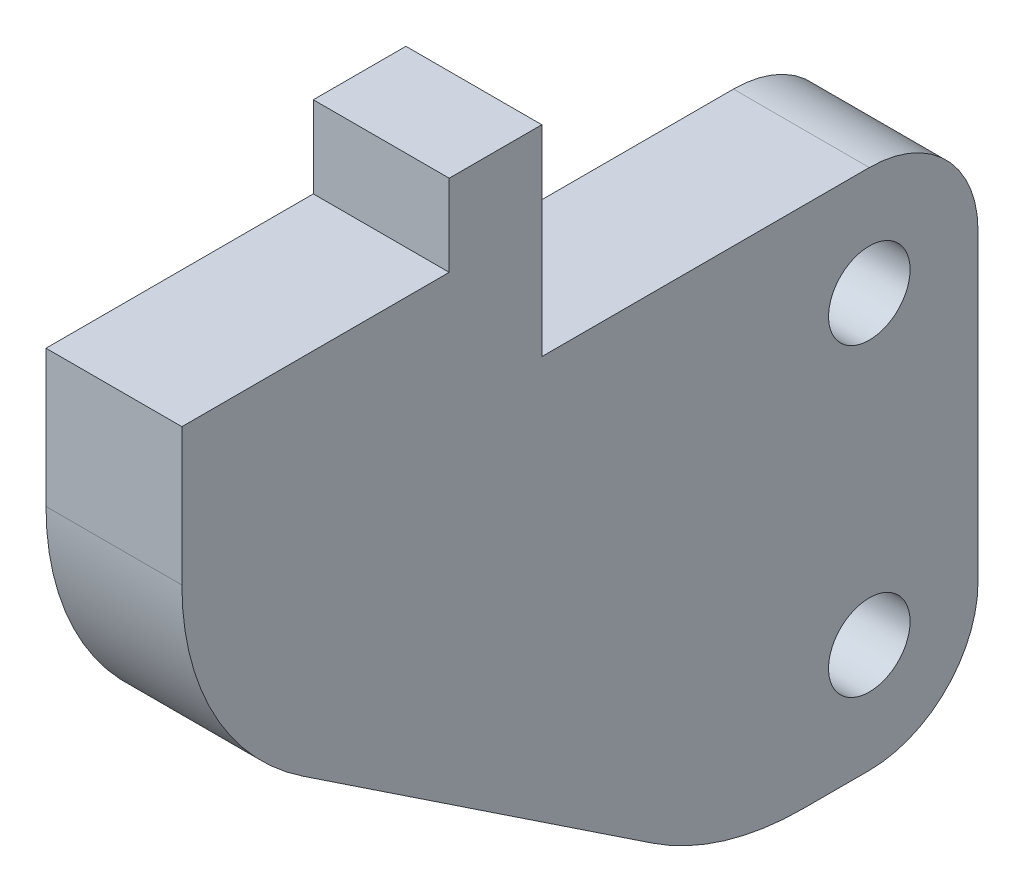
ISO-10303-21;
HEADER;
FILE_DESCRIPTION(('STEP AP214'),'2;1');
FILE_NAME('part.step','',(''),(''),'','','');
FILE_SCHEMA(('AUTOMOTIVE_DESIGN { 1 0 10303 214 1 1 1 1 }'));
ENDSEC;
DATA;
#1=APPLICATION_CONTEXT('core data for automotive mechanical design processes');
#2=APPLICATION_PROTOCOL_DEFINITION('international standard','automotive_design',2000,#1);
#3=PRODUCT_CONTEXT('',#1,'mechanical');
#4=PRODUCT('Part','Part','',(#3));
#5=PRODUCT_RELATED_PRODUCT_CATEGORY('part','',(#4));
#6=PRODUCT_DEFINITION_FORMATION('','',#4);
#7=PRODUCT_DEFINITION_CONTEXT('part definition',#1,'design');
#8=PRODUCT_DEFINITION('design','',#6,#7);
#9=PRODUCT_DEFINITION_SHAPE('','',#8);
#10=(LENGTH_UNIT() NAMED_UNIT(*) SI_UNIT(.MILLI.,.METRE.));
#11=(NAMED_UNIT(*) PLANE_ANGLE_UNIT() SI_UNIT($,.RADIAN.));
#12=(NAMED_UNIT(*) SI_UNIT($,.STERADIAN.) SOLID_ANGLE_UNIT());
#13=UNCERTAINTY_MEASURE_WITH_UNIT(LENGTH_MEASURE(1.E-05),#10,'distance_accuracy_value','');
#14=(GEOMETRIC_REPRESENTATION_CONTEXT(3) GLOBAL_UNCERTAINTY_ASSIGNED_CONTEXT((#13)) GLOBAL_UNIT_ASSIGNED_CONTEXT((#10,
#11,#12)) REPRESENTATION_CONTEXT('',''));
#15=CARTESIAN_POINT('',(0.,0.,0.));
#16=DIRECTION('',(0.,0.,1.));
#17=DIRECTION('',(1.,0.,0.));
#18=AXIS2_PLACEMENT_3D('',#15,#16,#17);
#19=CARTESIAN_POINT('',(5.,73.9444814686594,-76.8456806276459));
#20=DIRECTION('',(-1.,0.,0.));
#21=DIRECTION('',(0.,0.,1.));
#22=AXIS2_PLACEMENT_3D('',#19,#20,#21);
#23=CYLINDRICAL_SURFACE('',#22,4.00000000000001);
#24=CARTESIAN_POINT('',(0.,73.9444814686594,-76.8456806276459));
#25=DIRECTION('',(1.,0.,0.));
#26=DIRECTION('',(0.,0.,-1.));
#27=AXIS2_PLACEMENT_3D('',#24,#25,#26);
#28=CIRCLE('',#27,4.00000000000001);
#29=CARTESIAN_POINT('',(0.,69.9444814686594,-76.8456806276459));
#30=VERTEX_POINT('',#29);
#31=CARTESIAN_POINT('',(0.,73.9444814686594,-80.8456806276459));
#32=VERTEX_POINT('',#31);
#33=EDGE_CURVE('E180',#30,#32,#28,.T.);
#34=ORIENTED_EDGE('',*,*,#33,.T.);
#35=DIRECTION('',(-1.,0.,0.));
#36=VECTOR('',#35,1.);
#37=CARTESIAN_POINT('',(5.,73.9444814686594,-80.8456806276459));
#38=LINE('',#37,#36);
#39=CARTESIAN_POINT('',(5.,73.9444814686594,-80.8456806276459));
#40=VERTEX_POINT('',#39);
#41=EDGE_CURVE('E11',#40,#32,#38,.T.);
#42=ORIENTED_EDGE('',*,*,#41,.F.);
#43=CARTESIAN_POINT('',(5.,73.9444814686594,-76.8456806276459));
#44=DIRECTION('',(1.,0.,0.));
#45=DIRECTION('',(0.,0.,-1.));
#46=AXIS2_PLACEMENT_3D('',#43,#44,#45);
#47=CIRCLE('',#46,4.00000000000001);
#48=CARTESIAN_POINT('',(5.,69.9444814686594,-76.8456806276459));
#49=VERTEX_POINT('',#48);
#50=EDGE_CURVE('E111',#49,#40,#47,.T.);
#51=ORIENTED_EDGE('',*,*,#50,.F.);
#52=DIRECTION('',(-1.,0.,0.));
#53=VECTOR('',#52,1.);
#54=CARTESIAN_POINT('',(5.,69.9444814686594,-76.8456806276459));
#55=LINE('',#54,#53);
#56=EDGE_CURVE('E59',#49,#30,#55,.T.);
#57=ORIENTED_EDGE('',*,*,#56,.T.);
#58=EDGE_LOOP('',(#34,#42,#51,#57));
#59=FACE_BOUND('',#58,.T.);
#60=ADVANCED_FACE('F41',(#59),#23,.T.);
#61=CARTESIAN_POINT('',(5.,0.,-80.8456806276459));
#62=DIRECTION('',(0.,0.,-1.));
#63=DIRECTION('',(-1.,0.,0.));
#64=AXIS2_PLACEMENT_3D('',#61,#62,#63);
#65=PLANE('',#64);
#66=DIRECTION('',(0.,-1.,0.));
#67=VECTOR('',#66,1.);
#68=CARTESIAN_POINT('',(0.,0.,-80.8456806276459));
#69=LINE('',#68,#67);
#70=CARTESIAN_POINT('',(0.,85.1580090825985,-80.8456806276459));
#71=VERTEX_POINT('',#70);
#72=EDGE_CURVE('E183',#71,#32,#69,.T.);
#73=ORIENTED_EDGE('',*,*,#72,.F.);
#74=DIRECTION('',(-1.,0.,0.));
#75=VECTOR('',#74,1.);
#76=CARTESIAN_POINT('',(5.,85.1580090825985,-80.8456806276459));
#77=LINE('',#76,#75);
#78=CARTESIAN_POINT('',(5.,85.1580090825985,-80.8456806276459));
#79=VERTEX_POINT('',#78);
#80=EDGE_CURVE('E51',#79,#71,#77,.T.);
#81=ORIENTED_EDGE('',*,*,#80,.F.);
#82=DIRECTION('',(0.,-1.,0.));
#83=VECTOR('',#82,1.);
#84=CARTESIAN_POINT('',(5.,0.,-80.8456806276459));
#85=LINE('',#84,#83);
#86=EDGE_CURVE('E275',#79,#40,#85,.T.);
#87=ORIENTED_EDGE('',*,*,#86,.T.);
#88=ORIENTED_EDGE('',*,*,#41,.T.);
#89=EDGE_LOOP('',(#73,#81,#87,#88));
#90=FACE_BOUND('',#89,.T.);
#91=ADVANCED_FACE('F274',(#90),#65,.T.);
#92=CARTESIAN_POINT('',(5.,85.1580090825985,-76.8456806276459));
#93=DIRECTION('',(-1.,0.,0.));
#94=DIRECTION('',(0.,0.,1.));
#95=AXIS2_PLACEMENT_3D('',#92,#93,#94);
#96=CYLINDRICAL_SURFACE('',#95,4.00000000000001);
#97=CARTESIAN_POINT('',(0.,85.1580090825985,-76.8456806276459));
#98=DIRECTION('',(1.,0.,0.));
#99=DIRECTION('',(0.,0.,-1.));
#100=AXIS2_PLACEMENT_3D('',#97,#98,#99);
#101=CIRCLE('',#100,4.00000000000001);
#102=CARTESIAN_POINT('',(0.,89.1580090825985,-76.8456806276459));
#103=VERTEX_POINT('',#102);
#104=EDGE_CURVE('E187',#71,#103,#101,.T.);
#105=ORIENTED_EDGE('',*,*,#104,.T.);
#106=DIRECTION('',(-1.,0.,0.));
#107=VECTOR('',#106,1.);
#108=CARTESIAN_POINT('',(5.,89.1580090825985,-76.8456806276459));
#109=LINE('',#108,#107);
#110=CARTESIAN_POINT('',(5.,89.1580090825985,-76.8456806276459));
#111=VERTEX_POINT('',#110);
#112=EDGE_CURVE('E256',#111,#103,#109,.T.);
#113=ORIENTED_EDGE('',*,*,#112,.F.);
#114=CARTESIAN_POINT('',(5.,85.1580090825985,-76.8456806276459));
#115=DIRECTION('',(1.,0.,0.));
#116=DIRECTION('',(0.,0.,-1.));
#117=AXIS2_PLACEMENT_3D('',#114,#115,#116);
#118=CIRCLE('',#117,4.00000000000001);
#119=EDGE_CURVE('E265',#79,#111,#118,.T.);
#120=ORIENTED_EDGE('',*,*,#119,.F.);
#121=ORIENTED_EDGE('',*,*,#80,.T.);
#122=EDGE_LOOP('',(#105,#113,#120,#121));
#123=FACE_BOUND('',#122,.T.);
#124=ADVANCED_FACE('F263',(#123),#96,.T.);
#125=CARTESIAN_POINT('',(5.,89.1580090825985,0.));
#126=DIRECTION('',(0.,-1.,0.));
#127=DIRECTION('',(0.,0.,-1.));
#128=AXIS2_PLACEMENT_3D('',#125,#126,#127);
#129=PLANE('',#128);
#130=DIRECTION('',(0.,0.,1.));
#131=VECTOR('',#130,1.);
#132=CARTESIAN_POINT('',(0.,89.1580090825985,0.));
#133=LINE('',#132,#131);
#134=CARTESIAN_POINT('',(0.,89.1580090825985,-64.7949383441951));
#135=VERTEX_POINT('',#134);
#136=EDGE_CURVE('E190',#103,#135,#133,.T.);
#137=ORIENTED_EDGE('',*,*,#136,.T.);
#138=DIRECTION('',(-1.,0.,0.));
#139=VECTOR('',#138,1.);
#140=CARTESIAN_POINT('',(5.,89.1580090825985,-64.7949383441951));
#141=LINE('',#140,#139);
#142=CARTESIAN_POINT('',(5.,89.1580090825985,-64.7949383441951));
#143=VERTEX_POINT('',#142);
#144=EDGE_CURVE('E252',#143,#135,#141,.T.);
#145=ORIENTED_EDGE('',*,*,#144,.F.);
#146=DIRECTION('',(0.,0.,1.));
#147=VECTOR('',#146,1.);
#148=CARTESIAN_POINT('',(5.,89.1580090825985,0.));
#149=LINE('',#148,#147);
#150=EDGE_CURVE('E397',#111,#143,#149,.T.);
#151=ORIENTED_EDGE('',*,*,#150,.F.);
#152=ORIENTED_EDGE('',*,*,#112,.T.);
#153=EDGE_LOOP('',(#137,#145,#151,#152));
#154=FACE_BOUND('',#153,.T.);
#155=ADVANCED_FACE('F295',(#154),#129,.F.);
#156=CARTESIAN_POINT('',(5.,0.,-64.7949383441951));
#157=DIRECTION('',(0.,0.,1.));
#158=DIRECTION('',(1.,0.,0.));
#159=AXIS2_PLACEMENT_3D('',#156,#157,#158);
#160=PLANE('',#159);
#161=DIRECTION('',(0.,1.,0.));
#162=VECTOR('',#161,1.);
#163=CARTESIAN_POINT('',(0.,0.,-64.7949383441951));
#164=LINE('',#163,#162);
#165=CARTESIAN_POINT('',(0.,96.5477397147833,-64.7949383441951));
#166=VERTEX_POINT('',#165);
#167=EDGE_CURVE('E193',#135,#166,#164,.T.);
#168=ORIENTED_EDGE('',*,*,#167,.T.);
#169=DIRECTION('',(-1.,0.,0.));
#170=VECTOR('',#169,1.);
#171=CARTESIAN_POINT('',(5.,96.5477397147833,-64.7949383441951));
#172=LINE('',#171,#170);
#173=CARTESIAN_POINT('',(5.,96.5477397147833,-64.7949383441951));
#174=VERTEX_POINT('',#173);
#175=EDGE_CURVE('E248',#174,#166,#172,.T.);
#176=ORIENTED_EDGE('',*,*,#175,.F.);
#177=DIRECTION('',(0.,1.,0.));
#178=VECTOR('',#177,1.);
#179=CARTESIAN_POINT('',(5.,0.,-64.7949383441951));
#180=LINE('',#179,#178);
#181=EDGE_CURVE('E400',#143,#174,#180,.T.);
#182=ORIENTED_EDGE('',*,*,#181,.F.);
#183=ORIENTED_EDGE('',*,*,#144,.T.);
#184=EDGE_LOOP('',(#168,#176,#182,#183));
#185=FACE_BOUND('',#184,.T.);
#186=ADVANCED_FACE('F298',(#185),#160,.F.);
#187=CARTESIAN_POINT('',(5.,96.5477397147833,0.));
#188=DIRECTION('',(0.,-1.,0.));
#189=DIRECTION('',(0.,0.,-1.));
#190=AXIS2_PLACEMENT_3D('',#187,#188,#189);
#191=PLANE('',#190);
#192=DIRECTION('',(0.,0.,1.));
#193=VECTOR('',#192,1.);
#194=CARTESIAN_POINT('',(0.,96.5477397147833,0.));
#195=LINE('',#194,#193);
#196=CARTESIAN_POINT('',(0.,96.5477397147833,-61.3869910945006));
#197=VERTEX_POINT('',#196);
#198=EDGE_CURVE('E196',#166,#197,#195,.T.);
#199=ORIENTED_EDGE('',*,*,#198,.T.);
#200=DIRECTION('',(-1.,0.,0.));
#201=VECTOR('',#200,1.);
#202=CARTESIAN_POINT('',(5.,96.5477397147833,-61.3869910945006));
#203=LINE('',#202,#201);
#204=CARTESIAN_POINT('',(5.,96.5477397147833,-61.3869910945006));
#205=VERTEX_POINT('',#204);
#206=EDGE_CURVE('E244',#205,#197,#203,.T.);
#207=ORIENTED_EDGE('',*,*,#206,.F.);
#208=DIRECTION('',(0.,0.,1.));
#209=VECTOR('',#208,1.);
#210=CARTESIAN_POINT('',(5.,96.5477397147833,0.));
#211=LINE('',#210,#209);
#212=EDGE_CURVE('E403',#174,#205,#211,.T.);
#213=ORIENTED_EDGE('',*,*,#212,.F.);
#214=ORIENTED_EDGE('',*,*,#175,.T.);
#215=EDGE_LOOP('',(#199,#207,#213,#214));
#216=FACE_BOUND('',#215,.T.);
#217=ADVANCED_FACE('F302',(#216),#191,.F.);
#218=CARTESIAN_POINT('',(5.,0.,-61.3869910945006));
#219=DIRECTION('',(0.,0.,-1.));
#220=DIRECTION('',(-1.,0.,0.));
#221=AXIS2_PLACEMENT_3D('',#218,#219,#220);
#222=PLANE('',#221);
#223=DIRECTION('',(0.,-1.,0.));
#224=VECTOR('',#223,1.);
#225=CARTESIAN_POINT('',(0.,0.,-61.3869910945006));
#226=LINE('',#225,#224);
#227=CARTESIAN_POINT('',(0.,93.5477397147833,-61.3869910945006));
#228=VERTEX_POINT('',#227);
#229=EDGE_CURVE('E199',#197,#228,#226,.T.);
#230=ORIENTED_EDGE('',*,*,#229,.T.);
#231=DIRECTION('',(-1.,0.,0.));
#232=VECTOR('',#231,1.);
#233=CARTESIAN_POINT('',(5.,93.5477397147833,-61.3869910945006));
#234=LINE('',#233,#232);
#235=CARTESIAN_POINT('',(5.,93.5477397147833,-61.3869910945006));
#236=VERTEX_POINT('',#235);
#237=EDGE_CURVE('E240',#236,#228,#234,.T.);
#238=ORIENTED_EDGE('',*,*,#237,.F.);
#239=DIRECTION('',(0.,-1.,0.));
#240=VECTOR('',#239,1.);
#241=CARTESIAN_POINT('',(5.,0.,-61.3869910945006));
#242=LINE('',#241,#240);
#243=EDGE_CURVE('E406',#205,#236,#242,.T.);
#244=ORIENTED_EDGE('',*,*,#243,.F.);
#245=ORIENTED_EDGE('',*,*,#206,.T.);
#246=EDGE_LOOP('',(#230,#238,#244,#245));
#247=FACE_BOUND('',#246,.T.);
#248=ADVANCED_FACE('F306',(#247),#222,.F.);
#249=CARTESIAN_POINT('',(5.,93.5477397147833,0.));
#250=DIRECTION('',(0.,-1.,0.));
#251=DIRECTION('',(0.,0.,-1.));
#252=AXIS2_PLACEMENT_3D('',#249,#250,#251);
#253=PLANE('',#252);
#254=DIRECTION('',(0.,0.,1.));
#255=VECTOR('',#254,1.);
#256=CARTESIAN_POINT('',(0.,93.5477397147833,0.));
#257=LINE('',#256,#255);
#258=CARTESIAN_POINT('',(0.,93.5477397147833,-51.5504160783371));
#259=VERTEX_POINT('',#258);
#260=EDGE_CURVE('E202',#228,#259,#257,.T.);
#261=ORIENTED_EDGE('',*,*,#260,.T.);
#262=DIRECTION('',(-1.,0.,0.));
#263=VECTOR('',#262,1.);
#264=CARTESIAN_POINT('',(5.,93.5477397147833,-51.5504160783371));
#265=LINE('',#264,#263);
#266=CARTESIAN_POINT('',(5.,93.5477397147833,-51.5504160783371));
#267=VERTEX_POINT('',#266);
#268=EDGE_CURVE('E236',#267,#259,#265,.T.);
#269=ORIENTED_EDGE('',*,*,#268,.F.);
#270=DIRECTION('',(0.,0.,1.));
#271=VECTOR('',#270,1.);
#272=CARTESIAN_POINT('',(5.,93.5477397147833,0.));
#273=LINE('',#272,#271);
#274=EDGE_CURVE('E409',#236,#267,#273,.T.);
#275=ORIENTED_EDGE('',*,*,#274,.F.);
#276=ORIENTED_EDGE('',*,*,#237,.T.);
#277=EDGE_LOOP('',(#261,#269,#275,#276));
#278=FACE_BOUND('',#277,.T.);
#279=ADVANCED_FACE('F310',(#278),#253,.F.);
#280=CARTESIAN_POINT('',(5.,0.,-51.5504160783371));
#281=DIRECTION('',(0.,0.,-1.));
#282=DIRECTION('',(-1.,0.,0.));
#283=AXIS2_PLACEMENT_3D('',#280,#281,#282);
#284=PLANE('',#283);
#285=DIRECTION('',(0.,-1.,0.));
#286=VECTOR('',#285,1.);
#287=CARTESIAN_POINT('',(0.,0.,-51.5504160783371));
#288=LINE('',#287,#286);
#289=CARTESIAN_POINT('',(0.,88.503490643643,-51.5504160783371));
#290=VERTEX_POINT('',#289);
#291=EDGE_CURVE('E205',#259,#290,#288,.T.);
#292=ORIENTED_EDGE('',*,*,#291,.T.);
#293=DIRECTION('',(-1.,0.,0.));
#294=VECTOR('',#293,1.);
#295=CARTESIAN_POINT('',(5.,88.503490643643,-51.5504160783371));
#296=LINE('',#295,#294);
#297=CARTESIAN_POINT('',(5.,88.503490643643,-51.5504160783371));
#298=VERTEX_POINT('',#297);
#299=EDGE_CURVE('E232',#298,#290,#296,.T.);
#300=ORIENTED_EDGE('',*,*,#299,.F.);
#301=DIRECTION('',(0.,-1.,0.));
#302=VECTOR('',#301,1.);
#303=CARTESIAN_POINT('',(5.,0.,-51.5504160783371));
#304=LINE('',#303,#302);
#305=EDGE_CURVE('E412',#267,#298,#304,.T.);
#306=ORIENTED_EDGE('',*,*,#305,.F.);
#307=ORIENTED_EDGE('',*,*,#268,.T.);
#308=EDGE_LOOP('',(#292,#300,#306,#307));
#309=FACE_BOUND('',#308,.T.);
#310=ADVANCED_FACE('F314',(#309),#284,.F.);
#311=CARTESIAN_POINT('',(5.,88.503490643643,-61.5504160783371));
#312=DIRECTION('',(-1.,0.,0.));
#313=DIRECTION('',(0.,0.,1.));
#314=AXIS2_PLACEMENT_3D('',#311,#312,#313);
#315=CYLINDRICAL_SURFACE('',#314,10.);
#316=CARTESIAN_POINT('',(0.,88.503490643643,-61.5504160783371));
#317=DIRECTION('',(1.,0.,0.));
#318=DIRECTION('',(0.,0.,-1.));
#319=AXIS2_PLACEMENT_3D('',#316,#317,#318);
#320=CIRCLE('',#319,10.);
#321=CARTESIAN_POINT('',(0.,80.180106847145,-56.007737828953));
#322=VERTEX_POINT('',#321);
#323=EDGE_CURVE('E208',#290,#322,#320,.T.);
#324=ORIENTED_EDGE('',*,*,#323,.T.);
#325=DIRECTION('',(-1.,0.,0.));
#326=VECTOR('',#325,1.);
#327=CARTESIAN_POINT('',(5.,80.180106847145,-56.007737828953));
#328=LINE('',#327,#326);
#329=CARTESIAN_POINT('',(5.,80.180106847145,-56.007737828953));
#330=VERTEX_POINT('',#329);
#331=EDGE_CURVE('E153',#330,#322,#328,.T.);
#332=ORIENTED_EDGE('',*,*,#331,.F.);
#333=CARTESIAN_POINT('',(5.,88.503490643643,-61.5504160783371));
#334=DIRECTION('',(1.,0.,0.));
#335=DIRECTION('',(0.,0.,-1.));
#336=AXIS2_PLACEMENT_3D('',#333,#334,#335);
#337=CIRCLE('',#336,10.);
#338=EDGE_CURVE('E160',#298,#330,#337,.T.);
#339=ORIENTED_EDGE('',*,*,#338,.F.);
#340=ORIENTED_EDGE('',*,*,#299,.T.);
#341=EDGE_LOOP('',(#324,#332,#339,#340));
#342=FACE_BOUND('',#341,.T.);
#343=ADVANCED_FACE('F318',(#342),#315,.T.);
#344=CARTESIAN_POINT('',(5.,81.3862691958279,-54.19645604472));
#345=DIRECTION('',(0.,-0.832338379649794,0.55426782493841));
#346=DIRECTION('',(0.,-0.55426782493841,-0.832338379649794));
#347=AXIS2_PLACEMENT_3D('',#344,#345,#346);
#348=PLANE('',#347);
#349=DIRECTION('',(0.,0.55426782493841,0.832338379649794));
#350=VECTOR('',#349,1.);
#351=CARTESIAN_POINT('',(0.,81.3862691958279,-54.19645604472));
#352=LINE('',#351,#350);
#353=CARTESIAN_POINT('',(0.,71.6210976721615,-68.8607152300949));
#354=VERTEX_POINT('',#353);
#355=EDGE_CURVE('E148',#354,#322,#352,.T.);
#356=ORIENTED_EDGE('',*,*,#355,.F.);
#357=DIRECTION('',(-1.,0.,0.));
#358=VECTOR('',#357,1.);
#359=CARTESIAN_POINT('',(5.,71.6210976721615,-68.8607152300949));
#360=LINE('',#359,#358);
#361=CARTESIAN_POINT('',(5.,71.6210976721615,-68.8607152300949));
#362=VERTEX_POINT('',#361);
#363=EDGE_CURVE('E143',#362,#354,#360,.T.);
#364=ORIENTED_EDGE('',*,*,#363,.F.);
#365=DIRECTION('',(0.,0.55426782493841,0.832338379649794));
#366=VECTOR('',#365,1.);
#367=CARTESIAN_POINT('',(5.,81.3862691958279,-54.19645604472));
#368=LINE('',#367,#366);
#369=EDGE_CURVE('E146',#362,#330,#368,.T.);
#370=ORIENTED_EDGE('',*,*,#369,.T.);
#371=ORIENTED_EDGE('',*,*,#331,.T.);
#372=EDGE_LOOP('',(#356,#364,#370,#371));
#373=FACE_BOUND('',#372,.T.);
#374=ADVANCED_FACE('F145',(#373),#348,.T.);
#375=CARTESIAN_POINT('',(5.,79.9444814686594,-74.403393479479));
#376=DIRECTION('',(-1.,0.,0.));
#377=DIRECTION('',(0.,0.,1.));
#378=AXIS2_PLACEMENT_3D('',#375,#376,#377);
#379=CYLINDRICAL_SURFACE('',#378,9.99999999999999);
#380=CARTESIAN_POINT('',(0.,79.9444814686594,-74.403393479479));
#381=DIRECTION('',(1.,0.,0.));
#382=DIRECTION('',(0.,0.,-1.));
#383=AXIS2_PLACEMENT_3D('',#380,#381,#382);
#384=CIRCLE('',#383,9.99999999999999);
#385=CARTESIAN_POINT('',(0.,69.9444814686594,-74.4033934794791));
#386=VERTEX_POINT('',#385);
#387=EDGE_CURVE('E214',#386,#354,#384,.F.);
#388=ORIENTED_EDGE('',*,*,#387,.F.);
#389=DIRECTION('',(-1.,0.,0.));
#390=VECTOR('',#389,1.);
#391=CARTESIAN_POINT('',(5.,69.9444814686594,-74.4033934794791));
#392=LINE('',#391,#390);
#393=CARTESIAN_POINT('',(5.,69.9444814686594,-74.4033934794791));
#394=VERTEX_POINT('',#393);
#395=EDGE_CURVE('E99',#394,#386,#392,.T.);
#396=ORIENTED_EDGE('',*,*,#395,.F.);
#397=CARTESIAN_POINT('',(5.,79.9444814686594,-74.403393479479));
#398=DIRECTION('',(1.,0.,0.));
#399=DIRECTION('',(0.,0.,-1.));
#400=AXIS2_PLACEMENT_3D('',#397,#398,#399);
#401=CIRCLE('',#400,9.99999999999999);
#402=EDGE_CURVE('E158',#394,#362,#401,.F.);
#403=ORIENTED_EDGE('',*,*,#402,.T.);
#404=ORIENTED_EDGE('',*,*,#363,.T.);
#405=EDGE_LOOP('',(#388,#396,#403,#404));
#406=FACE_BOUND('',#405,.T.);
#407=ADVANCED_FACE('F164',(#406),#379,.T.);
#408=CARTESIAN_POINT('',(5.,69.9444814686594,0.));
#409=DIRECTION('',(0.,-1.,0.));
#410=DIRECTION('',(0.,0.,-1.));
#411=AXIS2_PLACEMENT_3D('',#408,#409,#410);
#412=PLANE('',#411);
#413=DIRECTION('',(0.,0.,1.));
#414=VECTOR('',#413,1.);
#415=CARTESIAN_POINT('',(0.,69.9444814686594,0.));
#416=LINE('',#415,#414);
#417=EDGE_CURVE('E217',#30,#386,#416,.T.);
#418=ORIENTED_EDGE('',*,*,#417,.F.);
#419=ORIENTED_EDGE('',*,*,#56,.F.);
#420=DIRECTION('',(0.,0.,1.));
#421=VECTOR('',#420,1.);
#422=CARTESIAN_POINT('',(5.,69.9444814686594,0.));
#423=LINE('',#422,#421);
#424=EDGE_CURVE('E166',#49,#394,#423,.T.);
#425=ORIENTED_EDGE('',*,*,#424,.T.);
#426=ORIENTED_EDGE('',*,*,#395,.T.);
#427=EDGE_LOOP('',(#418,#419,#425,#426));
#428=FACE_BOUND('',#427,.T.);
#429=ADVANCED_FACE('F276',(#428),#412,.T.);
#430=CARTESIAN_POINT('',(5.,73.9444814686594,-76.8456806276459));
#431=DIRECTION('',(-1.,0.,0.));
#432=DIRECTION('',(0.,0.,1.));
#433=AXIS2_PLACEMENT_3D('',#430,#431,#432);
#434=CYLINDRICAL_SURFACE('',#433,1.5);
#435=CARTESIAN_POINT('',(5.,73.9444814686594,-76.8456806276459));
#436=DIRECTION('',(1.,0.,0.));
#437=DIRECTION('',(0.,0.,-1.));
#438=AXIS2_PLACEMENT_3D('',#435,#436,#437);
#439=CIRCLE('',#438,1.5);
#440=CARTESIAN_POINT('',(5.,73.9444814686594,-78.3456806276459));
#441=VERTEX_POINT('',#440);
#442=EDGE_CURVE('E225',#441,#441,#439,.T.);
#443=ORIENTED_EDGE('',*,*,#442,.T.);
#444=EDGE_LOOP('',(#443));
#445=FACE_BOUND('',#444,.T.);
#446=CARTESIAN_POINT('',(0.,73.9444814686594,-76.8456806276459));
#447=DIRECTION('',(1.,0.,0.));
#448=DIRECTION('',(0.,0.,-1.));
#449=AXIS2_PLACEMENT_3D('',#446,#447,#448);
#450=CIRCLE('',#449,1.5);
#451=CARTESIAN_POINT('',(0.,73.9444814686594,-78.3456806276459));
#452=VERTEX_POINT('',#451);
#453=EDGE_CURVE('E176',#452,#452,#450,.T.);
#454=ORIENTED_EDGE('',*,*,#453,.F.);
#455=EDGE_LOOP('',(#454));
#456=FACE_BOUND('',#455,.T.);
#457=ADVANCED_FACE('F43',(#445,#456),#434,.F.);
#458=CARTESIAN_POINT('',(5.,85.1580090825985,-76.8456806276459));
#459=DIRECTION('',(-1.,0.,0.));
#460=DIRECTION('',(0.,0.,1.));
#461=AXIS2_PLACEMENT_3D('',#458,#459,#460);
#462=CYLINDRICAL_SURFACE('',#461,1.5);
#463=CARTESIAN_POINT('',(5.,85.1580090825985,-76.8456806276459));
#464=DIRECTION('',(1.,0.,0.));
#465=DIRECTION('',(0.,0.,-1.));
#466=AXIS2_PLACEMENT_3D('',#463,#464,#465);
#467=CIRCLE('',#466,1.5);
#468=CARTESIAN_POINT('',(5.,85.1580090825985,-78.3456806276459));
#469=VERTEX_POINT('',#468);
#470=EDGE_CURVE('E169',#469,#469,#467,.T.);
#471=ORIENTED_EDGE('',*,*,#470,.T.);
#472=EDGE_LOOP('',(#471));
#473=FACE_BOUND('',#472,.T.);
#474=CARTESIAN_POINT('',(0.,85.1580090825985,-76.8456806276459));
#475=DIRECTION('',(1.,0.,0.));
#476=DIRECTION('',(0.,0.,-1.));
#477=AXIS2_PLACEMENT_3D('',#474,#475,#476);
#478=CIRCLE('',#477,1.5);
#479=CARTESIAN_POINT('',(0.,85.1580090825985,-78.3456806276459));
#480=VERTEX_POINT('',#479);
#481=EDGE_CURVE('E221',#480,#480,#478,.T.);
#482=ORIENTED_EDGE('',*,*,#481,.F.);
#483=EDGE_LOOP('',(#482));
#484=FACE_BOUND('',#483,.T.);
#485=ADVANCED_FACE('F283',(#473,#484),#462,.F.);
#486=CARTESIAN_POINT('',(5.,0.,0.));
#487=DIRECTION('',(1.,0.,0.));
#488=DIRECTION('',(0.,0.,-1.));
#489=AXIS2_PLACEMENT_3D('',#486,#487,#488);
#490=PLANE('',#489);
#491=ORIENTED_EDGE('',*,*,#442,.F.);
#492=EDGE_LOOP('',(#491));
#493=FACE_BOUND('',#492,.T.);
#494=ORIENTED_EDGE('',*,*,#50,.T.);
#495=ORIENTED_EDGE('',*,*,#86,.F.);
#496=ORIENTED_EDGE('',*,*,#119,.T.);
#497=ORIENTED_EDGE('',*,*,#150,.T.);
#498=ORIENTED_EDGE('',*,*,#181,.T.);
#499=ORIENTED_EDGE('',*,*,#212,.T.);
#500=ORIENTED_EDGE('',*,*,#243,.T.);
#501=ORIENTED_EDGE('',*,*,#274,.T.);
#502=ORIENTED_EDGE('',*,*,#305,.T.);
#503=ORIENTED_EDGE('',*,*,#338,.T.);
#504=ORIENTED_EDGE('',*,*,#369,.F.);
#505=ORIENTED_EDGE('',*,*,#402,.F.);
#506=ORIENTED_EDGE('',*,*,#424,.F.);
#507=EDGE_LOOP('',(#494,#495,#496,#497,#498,#499,#500,#501,#502,#503,#504,#505,#506));
#508=FACE_BOUND('',#507,.T.);
#509=ORIENTED_EDGE('',*,*,#470,.F.);
#510=EDGE_LOOP('',(#509));
#511=FACE_BOUND('',#510,.T.);
#512=ADVANCED_FACE('F156',(#493,#508,#511),#490,.T.);
#513=CARTESIAN_POINT('',(0.,0.,0.));
#514=DIRECTION('',(1.,0.,0.));
#515=DIRECTION('',(0.,0.,-1.));
#516=AXIS2_PLACEMENT_3D('',#513,#514,#515);
#517=PLANE('',#516);
#518=ORIENTED_EDGE('',*,*,#453,.T.);
#519=EDGE_LOOP('',(#518));
#520=FACE_BOUND('',#519,.T.);
#521=ORIENTED_EDGE('',*,*,#33,.F.);
#522=ORIENTED_EDGE('',*,*,#417,.T.);
#523=ORIENTED_EDGE('',*,*,#387,.T.);
#524=ORIENTED_EDGE('',*,*,#355,.T.);
#525=ORIENTED_EDGE('',*,*,#323,.F.);
#526=ORIENTED_EDGE('',*,*,#291,.F.);
#527=ORIENTED_EDGE('',*,*,#260,.F.);
#528=ORIENTED_EDGE('',*,*,#229,.F.);
#529=ORIENTED_EDGE('',*,*,#198,.F.);
#530=ORIENTED_EDGE('',*,*,#167,.F.);
#531=ORIENTED_EDGE('',*,*,#136,.F.);
#532=ORIENTED_EDGE('',*,*,#104,.F.);
#533=ORIENTED_EDGE('',*,*,#72,.T.);
#534=EDGE_LOOP('',(#521,#522,#523,#524,#525,#526,#527,#528,#529,#530,#531,#532,#533));
#535=FACE_BOUND('',#534,.T.);
#536=ORIENTED_EDGE('',*,*,#481,.T.);
#537=EDGE_LOOP('',(#536));
#538=FACE_BOUND('',#537,.T.);
#539=ADVANCED_FACE('F271',(#520,#535,#538),#517,.F.);
#540=CLOSED_SHELL('',(#60,#91,#124,#155,#186,#217,#248,#279,#310,#343,#374,#407,#429,#457,#485,
#512,#539));
#541=MANIFOLD_SOLID_BREP('B2',#540);
#542=ADVANCED_BREP_SHAPE_REPRESENTATION('',(#18,#541),#14);
#543=SHAPE_DEFINITION_REPRESENTATION(#9,#542);
ENDSEC;
END-ISO-10303-21;
